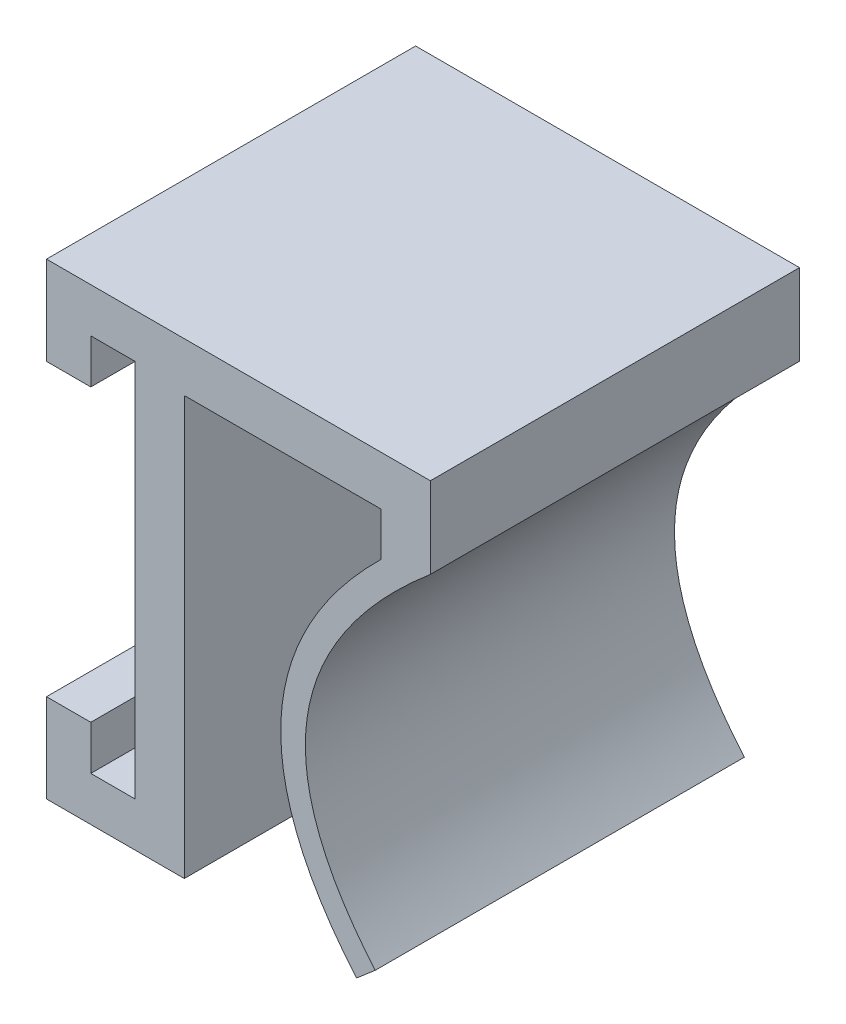
ISO-10303-21;
HEADER;
FILE_DESCRIPTION(('STEP AP214'),'2;1');
FILE_NAME('part.step','',(''),(''),'','','');
FILE_SCHEMA(('AUTOMOTIVE_DESIGN { 1 0 10303 214 1 1 1 1 }'));
ENDSEC;
DATA;
#1=APPLICATION_CONTEXT('core data for automotive mechanical design processes');
#2=APPLICATION_PROTOCOL_DEFINITION('international standard','automotive_design',2000,#1);
#3=PRODUCT_CONTEXT('',#1,'mechanical');
#4=PRODUCT('Part','Part','',(#3));
#5=PRODUCT_RELATED_PRODUCT_CATEGORY('part','',(#4));
#6=PRODUCT_DEFINITION_FORMATION('','',#4);
#7=PRODUCT_DEFINITION_CONTEXT('part definition',#1,'design');
#8=PRODUCT_DEFINITION('design','',#6,#7);
#9=PRODUCT_DEFINITION_SHAPE('','',#8);
#10=(LENGTH_UNIT() NAMED_UNIT(*) SI_UNIT(.MILLI.,.METRE.));
#11=(NAMED_UNIT(*) PLANE_ANGLE_UNIT() SI_UNIT($,.RADIAN.));
#12=(NAMED_UNIT(*) SI_UNIT($,.STERADIAN.) SOLID_ANGLE_UNIT());
#13=UNCERTAINTY_MEASURE_WITH_UNIT(LENGTH_MEASURE(1.E-05),#10,'distance_accuracy_value','');
#14=(GEOMETRIC_REPRESENTATION_CONTEXT(3) GLOBAL_UNCERTAINTY_ASSIGNED_CONTEXT((#13)) GLOBAL_UNIT_ASSIGNED_CONTEXT((#10,
#11,#12)) REPRESENTATION_CONTEXT('',''));
#15=CARTESIAN_POINT('',(0.,0.,0.));
#16=DIRECTION('',(0.,0.,1.));
#17=DIRECTION('',(1.,0.,0.));
#18=AXIS2_PLACEMENT_3D('',#15,#16,#17);
#19=CARTESIAN_POINT('',(-4.6,7.7,0.));
#20=DIRECTION('',(0.,1.,0.));
#21=DIRECTION('',(0.,0.,1.));
#22=AXIS2_PLACEMENT_3D('',#19,#20,#21);
#23=PLANE('',#22);
#24=DIRECTION('',(0.,0.,1.));
#25=VECTOR('',#24,1.);
#26=CARTESIAN_POINT('',(-2.8,7.7,0.));
#27=LINE('',#26,#25);
#28=CARTESIAN_POINT('',(-2.8,7.7,0.));
#29=VERTEX_POINT('',#28);
#30=CARTESIAN_POINT('',(-2.8,7.7,15.));
#31=VERTEX_POINT('',#30);
#32=EDGE_CURVE('E191',#29,#31,#27,.T.);
#33=ORIENTED_EDGE('',*,*,#32,.F.);
#34=DIRECTION('',(1.,0.,0.));
#35=VECTOR('',#34,1.);
#36=CARTESIAN_POINT('',(-4.6,7.7,0.));
#37=LINE('',#36,#35);
#38=CARTESIAN_POINT('',(-1.,7.7,0.));
#39=VERTEX_POINT('',#38);
#40=EDGE_CURVE('E39',#29,#39,#37,.T.);
#41=ORIENTED_EDGE('',*,*,#40,.T.);
#42=DIRECTION('',(0.,0.,1.));
#43=VECTOR('',#42,1.);
#44=CARTESIAN_POINT('',(-1.,7.7,0.));
#45=LINE('',#44,#43);
#46=CARTESIAN_POINT('',(-1.,7.7,15.));
#47=VERTEX_POINT('',#46);
#48=EDGE_CURVE('E176',#39,#47,#45,.T.);
#49=ORIENTED_EDGE('',*,*,#48,.T.);
#50=DIRECTION('',(1.,0.,0.));
#51=VECTOR('',#50,1.);
#52=CARTESIAN_POINT('',(-4.6,7.7,15.));
#53=LINE('',#52,#51);
#54=EDGE_CURVE('E232',#31,#47,#53,.T.);
#55=ORIENTED_EDGE('',*,*,#54,.F.);
#56=EDGE_LOOP('',(#33,#41,#49,#55));
#57=FACE_BOUND('',#56,.T.);
#58=ADVANCED_FACE('F35',(#57),#23,.F.);
#59=CARTESIAN_POINT('',(-4.6,-7.7,15.));
#60=DIRECTION('',(0.,-1.,0.));
#61=DIRECTION('',(0.,0.,-1.));
#62=AXIS2_PLACEMENT_3D('',#59,#60,#61);
#63=PLANE('',#62);
#64=DIRECTION('',(0.,0.,-1.));
#65=VECTOR('',#64,1.);
#66=CARTESIAN_POINT('',(-2.8,-7.7,15.));
#67=LINE('',#66,#65);
#68=CARTESIAN_POINT('',(-2.8,-7.7,15.));
#69=VERTEX_POINT('',#68);
#70=CARTESIAN_POINT('',(-2.8,-7.7,0.));
#71=VERTEX_POINT('',#70);
#72=EDGE_CURVE('E201',#69,#71,#67,.T.);
#73=ORIENTED_EDGE('',*,*,#72,.F.);
#74=DIRECTION('',(1.,0.,0.));
#75=VECTOR('',#74,1.);
#76=CARTESIAN_POINT('',(-4.6,-7.7,15.));
#77=LINE('',#76,#75);
#78=CARTESIAN_POINT('',(-1.,-7.7,15.));
#79=VERTEX_POINT('',#78);
#80=EDGE_CURVE('E228',#69,#79,#77,.T.);
#81=ORIENTED_EDGE('',*,*,#80,.T.);
#82=DIRECTION('',(0.,0.,-1.));
#83=VECTOR('',#82,1.);
#84=CARTESIAN_POINT('',(-1.,-7.7,15.));
#85=LINE('',#84,#83);
#86=CARTESIAN_POINT('',(-1.,-7.7,0.));
#87=VERTEX_POINT('',#86);
#88=EDGE_CURVE('E217',#79,#87,#85,.T.);
#89=ORIENTED_EDGE('',*,*,#88,.T.);
#90=DIRECTION('',(1.,0.,0.));
#91=VECTOR('',#90,1.);
#92=CARTESIAN_POINT('',(-4.6,-7.7,0.));
#93=LINE('',#92,#91);
#94=EDGE_CURVE('E53',#71,#87,#93,.T.);
#95=ORIENTED_EDGE('',*,*,#94,.F.);
#96=EDGE_LOOP('',(#73,#81,#89,#95));
#97=FACE_BOUND('',#96,.T.);
#98=ADVANCED_FACE('F357',(#97),#63,.F.);
#99=CARTESIAN_POINT('',(-1.,0.,15.));
#100=DIRECTION('',(-1.,0.,0.));
#101=DIRECTION('',(0.,0.,1.));
#102=AXIS2_PLACEMENT_3D('',#99,#100,#101);
#103=PLANE('',#102);
#104=DIRECTION('',(0.,1.,0.));
#105=VECTOR('',#104,1.);
#106=CARTESIAN_POINT('',(-1.,0.,0.));
#107=LINE('',#106,#105);
#108=EDGE_CURVE('E249',#87,#39,#107,.T.);
#109=ORIENTED_EDGE('',*,*,#108,.F.);
#110=ORIENTED_EDGE('',*,*,#88,.F.);
#111=DIRECTION('',(0.,1.,0.));
#112=VECTOR('',#111,1.);
#113=CARTESIAN_POINT('',(-1.,0.,15.));
#114=LINE('',#113,#112);
#115=EDGE_CURVE('E244',#79,#47,#114,.T.);
#116=ORIENTED_EDGE('',*,*,#115,.T.);
#117=ORIENTED_EDGE('',*,*,#48,.F.);
#118=EDGE_LOOP('',(#109,#110,#116,#117));
#119=FACE_BOUND('',#118,.T.);
#120=ADVANCED_FACE('F354',(#119),#103,.T.);
#121=CARTESIAN_POINT('',(9.00000000000001,0.,15.));
#122=DIRECTION('',(1.,0.,0.));
#123=DIRECTION('',(0.,1.,0.));
#124=AXIS2_PLACEMENT_3D('',#121,#122,#123);
#125=PLANE('',#124);
#126=DIRECTION('',(0.,-1.,0.));
#127=VECTOR('',#126,1.);
#128=CARTESIAN_POINT('',(9.00000000000001,0.,0.));
#129=LINE('',#128,#127);
#130=CARTESIAN_POINT('',(9.,7.5,0.));
#131=VERTEX_POINT('',#130);
#132=CARTESIAN_POINT('',(9.00000000000039,5.73432637373186,0.));
#133=VERTEX_POINT('',#132);
#134=EDGE_CURVE('E261',#131,#133,#129,.T.);
#135=ORIENTED_EDGE('',*,*,#134,.T.);
#136=DIRECTION('',(0.,0.,-1.));
#137=VECTOR('',#136,1.);
#138=CARTESIAN_POINT('',(9.00000000000039,5.73432637373186,15.));
#139=LINE('',#138,#137);
#140=CARTESIAN_POINT('',(9.00000000000039,5.73432637373186,15.));
#141=VERTEX_POINT('',#140);
#142=EDGE_CURVE('E11',#141,#133,#139,.T.);
#143=ORIENTED_EDGE('',*,*,#142,.F.);
#144=DIRECTION('',(0.,-1.,0.));
#145=VECTOR('',#144,1.);
#146=CARTESIAN_POINT('',(9.00000000000001,0.,15.));
#147=LINE('',#146,#145);
#148=CARTESIAN_POINT('',(9.,7.5,15.));
#149=VERTEX_POINT('',#148);
#150=EDGE_CURVE('E235',#149,#141,#147,.T.);
#151=ORIENTED_EDGE('',*,*,#150,.F.);
#152=DIRECTION('',(0.,0.,-1.));
#153=VECTOR('',#152,1.);
#154=CARTESIAN_POINT('',(9.,7.5,15.));
#155=LINE('',#154,#153);
#156=EDGE_CURVE('E260',#149,#131,#155,.T.);
#157=ORIENTED_EDGE('',*,*,#156,.T.);
#158=EDGE_LOOP('',(#135,#143,#151,#157));
#159=FACE_BOUND('',#158,.T.);
#160=ADVANCED_FACE('F37',(#159),#125,.F.);
#161=CARTESIAN_POINT('',(11.,7.5,15.));
#162=CARTESIAN_POINT('',(0.592095981717063,-0.840980976825272,15.));
#163=CARTESIAN_POINT('',(8.,-9.5,15.));
#164=B_SPLINE_CURVE_WITH_KNOTS('',2,(#161,#162,#163),.UNSPECIFIED.,.F.,.F.,(3,3),(0.,1.),.UNSPECIFIED.);
#165=DIRECTION('',(0.,0.,-1.));
#166=VECTOR('',#165,1.);
#167=SURFACE_OF_LINEAR_EXTRUSION('',#164,#166);
#168=CARTESIAN_POINT('',(11.,7.5,0.));
#169=CARTESIAN_POINT('',(0.592095981717063,-0.840980976825272,0.));
#170=CARTESIAN_POINT('',(8.,-9.5,0.));
#171=B_SPLINE_CURVE_WITH_KNOTS('',2,(#168,#169,#170),.UNSPECIFIED.,.F.,.F.,(3,3),(0.,1.),.UNSPECIFIED.);
#172=CARTESIAN_POINT('',(8.,-9.5,0.));
#173=VERTEX_POINT('',#172);
#174=EDGE_CURVE('E264',#133,#173,#171,.T.);
#175=ORIENTED_EDGE('',*,*,#174,.T.);
#176=DIRECTION('',(0.,0.,-1.));
#177=VECTOR('',#176,1.);
#178=CARTESIAN_POINT('',(8.,-9.5,15.));
#179=LINE('',#178,#177);
#180=CARTESIAN_POINT('',(8.,-9.5,15.));
#181=VERTEX_POINT('',#180);
#182=EDGE_CURVE('E45',#181,#173,#179,.T.);
#183=ORIENTED_EDGE('',*,*,#182,.F.);
#184=EDGE_CURVE('E330',#141,#181,#164,.T.);
#185=ORIENTED_EDGE('',*,*,#184,.F.);
#186=ORIENTED_EDGE('',*,*,#142,.T.);
#187=EDGE_LOOP('',(#175,#183,#185,#186));
#188=FACE_BOUND('',#187,.T.);
#189=ADVANCED_FACE('F316',(#188),#167,.F.);
#190=CARTESIAN_POINT('',(8.07354584516219,-9.43708056762009,15.));
#191=DIRECTION('',(0.650077174667521,-0.759868190527998,0.));
#192=DIRECTION('',(0.759868190527998,0.650077174667521,0.));
#193=AXIS2_PLACEMENT_3D('',#190,#191,#192);
#194=PLANE('',#193);
#195=DIRECTION('',(-0.759868190527998,-0.650077174667521,0.));
#196=VECTOR('',#195,1.);
#197=CARTESIAN_POINT('',(8.07354584516219,-9.43708056762009,0.));
#198=LINE('',#197,#196);
#199=CARTESIAN_POINT('',(8.759868190528,-8.84992282533248,0.));
#200=VERTEX_POINT('',#199);
#201=EDGE_CURVE('E269',#200,#173,#198,.T.);
#202=ORIENTED_EDGE('',*,*,#201,.F.);
#203=DIRECTION('',(0.,0.,-1.));
#204=VECTOR('',#203,1.);
#205=CARTESIAN_POINT('',(8.759868190528,-8.84992282533248,15.));
#206=LINE('',#205,#204);
#207=CARTESIAN_POINT('',(8.759868190528,-8.84992282533248,15.));
#208=VERTEX_POINT('',#207);
#209=EDGE_CURVE('E307',#208,#200,#206,.T.);
#210=ORIENTED_EDGE('',*,*,#209,.F.);
#211=DIRECTION('',(-0.759868190527998,-0.650077174667521,0.));
#212=VECTOR('',#211,1.);
#213=CARTESIAN_POINT('',(8.07354584516219,-9.43708056762009,15.));
#214=LINE('',#213,#212);
#215=EDGE_CURVE('E314',#208,#181,#214,.T.);
#216=ORIENTED_EDGE('',*,*,#215,.T.);
#217=ORIENTED_EDGE('',*,*,#182,.T.);
#218=EDGE_LOOP('',(#202,#210,#216,#217));
#219=FACE_BOUND('',#218,.T.);
#220=ADVANCED_FACE('F312',(#219),#194,.T.);
#221=CARTESIAN_POINT('',(11.6252023520057,6.71987289932823,15.));
#222=CARTESIAN_POINT('',(11.2201200589902,6.39522829510964,15.));
#223=CARTESIAN_POINT('',(10.4068109883159,5.70660676669036,15.));
#224=CARTESIAN_POINT('',(9.02350357029025,4.3793638637013,15.));
#225=CARTESIAN_POINT('',(7.63170789449937,2.72393121403036,15.));
#226=CARTESIAN_POINT('',(6.52663273633452,0.788286780544515,15.));
#227=CARTESIAN_POINT('',(5.9482411045491,-1.09822776469567,15.));
#228=CARTESIAN_POINT('',(5.8646344959865,-2.96072734929349,15.));
#229=CARTESIAN_POINT('',(6.26749430991719,-4.85251733804873,15.));
#230=CARTESIAN_POINT('',(7.04066869306095,-6.49045684792217,15.));
#231=CARTESIAN_POINT('',(7.92360645115797,-7.82176495390924,15.));
#232=CARTESIAN_POINT('',(8.47789668371057,-8.5203376802509,15.));
#233=CARTESIAN_POINT('',(8.75986819052797,-8.84992282533248,15.));
#234=B_SPLINE_CURVE_WITH_KNOTS('',3,(#221,#222,#223,#224,#225,#226,#227,#228,#229,#230,#231,
#232,#233),.UNSPECIFIED.,.F.,.F.,(4,1,1,1,1,1,1,1,1,1,4),(0.,0.0625,0.125,0.25,0.375,0.5,0.625,
0.75,0.875,0.9375,1.),.UNSPECIFIED.);
#235=DIRECTION('',(0.,0.,-1.));
#236=VECTOR('',#235,1.);
#237=SURFACE_OF_LINEAR_EXTRUSION('',#234,#236);
#238=CARTESIAN_POINT('',(11.6252023520057,6.71987289932823,0.));
#239=CARTESIAN_POINT('',(11.2201200589902,6.39522829510964,0.));
#240=CARTESIAN_POINT('',(10.4068109883159,5.70660676669036,0.));
#241=CARTESIAN_POINT('',(9.02350357029025,4.3793638637013,0.));
#242=CARTESIAN_POINT('',(7.63170789449937,2.72393121403036,0.));
#243=CARTESIAN_POINT('',(6.52663273633452,0.788286780544515,0.));
#244=CARTESIAN_POINT('',(5.9482411045491,-1.09822776469567,0.));
#245=CARTESIAN_POINT('',(5.8646344959865,-2.96072734929349,0.));
#246=CARTESIAN_POINT('',(6.26749430991719,-4.85251733804873,0.));
#247=CARTESIAN_POINT('',(7.04066869306095,-6.49045684792217,0.));
#248=CARTESIAN_POINT('',(7.92360645115797,-7.82176495390924,0.));
#249=CARTESIAN_POINT('',(8.47789668371057,-8.5203376802509,0.));
#250=CARTESIAN_POINT('',(8.75986819052797,-8.84992282533248,0.));
#251=B_SPLINE_CURVE_WITH_KNOTS('',3,(#238,#239,#240,#241,#242,#243,#244,#245,#246,#247,#248,
#249,#250),.UNSPECIFIED.,.F.,.F.,(4,1,1,1,1,1,1,1,1,1,4),(0.,0.0625,0.125,0.25,0.375,0.5,0.625,
0.75,0.875,0.9375,1.),.UNSPECIFIED.);
#252=CARTESIAN_POINT('',(11.,6.20409363639073,0.));
#253=VERTEX_POINT('',#252);
#254=EDGE_CURVE('E275',#253,#200,#251,.T.);
#255=ORIENTED_EDGE('',*,*,#254,.F.);
#256=DIRECTION('',(0.,0.,-1.));
#257=VECTOR('',#256,1.);
#258=CARTESIAN_POINT('',(11.,6.20409363639073,15.));
#259=LINE('',#258,#257);
#260=CARTESIAN_POINT('',(11.,6.20409363639073,15.));
#261=VERTEX_POINT('',#260);
#262=EDGE_CURVE('E305',#261,#253,#259,.T.);
#263=ORIENTED_EDGE('',*,*,#262,.F.);
#264=EDGE_CURVE('E324',#261,#208,#234,.T.);
#265=ORIENTED_EDGE('',*,*,#264,.T.);
#266=ORIENTED_EDGE('',*,*,#209,.T.);
#267=EDGE_LOOP('',(#255,#263,#265,#266));
#268=FACE_BOUND('',#267,.T.);
#269=ADVANCED_FACE('F321',(#268),#237,.T.);
#270=CARTESIAN_POINT('',(11.,0.,15.));
#271=DIRECTION('',(1.,0.,0.));
#272=DIRECTION('',(0.,1.,0.));
#273=AXIS2_PLACEMENT_3D('',#270,#271,#272);
#274=PLANE('',#273);
#275=DIRECTION('',(0.,-1.,0.));
#276=VECTOR('',#275,1.);
#277=CARTESIAN_POINT('',(11.,0.,0.));
#278=LINE('',#277,#276);
#279=CARTESIAN_POINT('',(11.,9.5,0.));
#280=VERTEX_POINT('',#279);
#281=EDGE_CURVE('E280',#280,#253,#278,.T.);
#282=ORIENTED_EDGE('',*,*,#281,.F.);
#283=DIRECTION('',(0.,0.,-1.));
#284=VECTOR('',#283,1.);
#285=CARTESIAN_POINT('',(11.,9.5,15.));
#286=LINE('',#285,#284);
#287=CARTESIAN_POINT('',(11.,9.5,15.));
#288=VERTEX_POINT('',#287);
#289=EDGE_CURVE('E303',#288,#280,#286,.T.);
#290=ORIENTED_EDGE('',*,*,#289,.F.);
#291=DIRECTION('',(0.,-1.,0.));
#292=VECTOR('',#291,1.);
#293=CARTESIAN_POINT('',(11.,0.,15.));
#294=LINE('',#293,#292);
#295=EDGE_CURVE('E332',#288,#261,#294,.T.);
#296=ORIENTED_EDGE('',*,*,#295,.T.);
#297=ORIENTED_EDGE('',*,*,#262,.T.);
#298=EDGE_LOOP('',(#282,#290,#296,#297));
#299=FACE_BOUND('',#298,.T.);
#300=ADVANCED_FACE('F347',(#299),#274,.T.);
#301=CARTESIAN_POINT('',(0.,9.5,15.));
#302=DIRECTION('',(0.,1.,0.));
#303=DIRECTION('',(0.,0.,1.));
#304=AXIS2_PLACEMENT_3D('',#301,#302,#303);
#305=PLANE('',#304);
#306=DIRECTION('',(1.,0.,0.));
#307=VECTOR('',#306,1.);
#308=CARTESIAN_POINT('',(0.,9.5,0.));
#309=LINE('',#308,#307);
#310=CARTESIAN_POINT('',(-4.6,9.5,0.));
#311=VERTEX_POINT('',#310);
#312=EDGE_CURVE('E286',#311,#280,#309,.T.);
#313=ORIENTED_EDGE('',*,*,#312,.F.);
#314=DIRECTION('',(0.,0.,-1.));
#315=VECTOR('',#314,1.);
#316=CARTESIAN_POINT('',(-4.6,9.5,0.));
#317=LINE('',#316,#315);
#318=CARTESIAN_POINT('',(-4.6,9.5,15.));
#319=VERTEX_POINT('',#318);
#320=EDGE_CURVE('E173',#319,#311,#317,.T.);
#321=ORIENTED_EDGE('',*,*,#320,.F.);
#322=DIRECTION('',(1.,0.,0.));
#323=VECTOR('',#322,1.);
#324=CARTESIAN_POINT('',(0.,9.5,15.));
#325=LINE('',#324,#323);
#326=EDGE_CURVE('E248',#319,#288,#325,.T.);
#327=ORIENTED_EDGE('',*,*,#326,.T.);
#328=ORIENTED_EDGE('',*,*,#289,.T.);
#329=EDGE_LOOP('',(#313,#321,#327,#328));
#330=FACE_BOUND('',#329,.T.);
#331=ADVANCED_FACE('F381',(#330),#305,.T.);
#332=CARTESIAN_POINT('',(0.,-9.5,15.));
#333=DIRECTION('',(0.,1.,0.));
#334=DIRECTION('',(0.,0.,1.));
#335=AXIS2_PLACEMENT_3D('',#332,#333,#334);
#336=PLANE('',#335);
#337=DIRECTION('',(1.,0.,0.));
#338=VECTOR('',#337,1.);
#339=CARTESIAN_POINT('',(0.,-9.5,0.));
#340=LINE('',#339,#338);
#341=CARTESIAN_POINT('',(-4.6,-9.5,0.));
#342=VERTEX_POINT('',#341);
#343=CARTESIAN_POINT('',(1.,-9.5,0.));
#344=VERTEX_POINT('',#343);
#345=EDGE_CURVE('E289',#342,#344,#340,.T.);
#346=ORIENTED_EDGE('',*,*,#345,.T.);
#347=DIRECTION('',(0.,0.,-1.));
#348=VECTOR('',#347,1.);
#349=CARTESIAN_POINT('',(1.,-9.5,15.));
#350=LINE('',#349,#348);
#351=CARTESIAN_POINT('',(1.,-9.5,15.));
#352=VERTEX_POINT('',#351);
#353=EDGE_CURVE('E300',#352,#344,#350,.T.);
#354=ORIENTED_EDGE('',*,*,#353,.F.);
#355=DIRECTION('',(1.,0.,0.));
#356=VECTOR('',#355,1.);
#357=CARTESIAN_POINT('',(0.,-9.5,15.));
#358=LINE('',#357,#356);
#359=CARTESIAN_POINT('',(-4.6,-9.5,15.));
#360=VERTEX_POINT('',#359);
#361=EDGE_CURVE('E247',#360,#352,#358,.T.);
#362=ORIENTED_EDGE('',*,*,#361,.F.);
#363=DIRECTION('',(0.,0.,1.));
#364=VECTOR('',#363,1.);
#365=CARTESIAN_POINT('',(-4.6,-9.5,15.));
#366=LINE('',#365,#364);
#367=EDGE_CURVE('E223',#342,#360,#366,.T.);
#368=ORIENTED_EDGE('',*,*,#367,.F.);
#369=EDGE_LOOP('',(#346,#354,#362,#368));
#370=FACE_BOUND('',#369,.T.);
#371=ADVANCED_FACE('F377',(#370),#336,.F.);
#372=CARTESIAN_POINT('',(1.,0.,15.));
#373=DIRECTION('',(-1.,0.,0.));
#374=DIRECTION('',(0.,-1.,0.));
#375=AXIS2_PLACEMENT_3D('',#372,#373,#374);
#376=PLANE('',#375);
#377=DIRECTION('',(0.,1.,0.));
#378=VECTOR('',#377,1.);
#379=CARTESIAN_POINT('',(1.,0.,0.));
#380=LINE('',#379,#378);
#381=CARTESIAN_POINT('',(1.,7.5,0.));
#382=VERTEX_POINT('',#381);
#383=EDGE_CURVE('E291',#344,#382,#380,.T.);
#384=ORIENTED_EDGE('',*,*,#383,.T.);
#385=DIRECTION('',(0.,0.,-1.));
#386=VECTOR('',#385,1.);
#387=CARTESIAN_POINT('',(1.,7.5,15.));
#388=LINE('',#387,#386);
#389=CARTESIAN_POINT('',(1.,7.5,15.));
#390=VERTEX_POINT('',#389);
#391=EDGE_CURVE('E297',#390,#382,#388,.T.);
#392=ORIENTED_EDGE('',*,*,#391,.F.);
#393=DIRECTION('',(0.,1.,0.));
#394=VECTOR('',#393,1.);
#395=CARTESIAN_POINT('',(1.,0.,15.));
#396=LINE('',#395,#394);
#397=EDGE_CURVE('E256',#352,#390,#396,.T.);
#398=ORIENTED_EDGE('',*,*,#397,.F.);
#399=ORIENTED_EDGE('',*,*,#353,.T.);
#400=EDGE_LOOP('',(#384,#392,#398,#399));
#401=FACE_BOUND('',#400,.T.);
#402=ADVANCED_FACE('F373',(#401),#376,.F.);
#403=CARTESIAN_POINT('',(0.,7.5,15.));
#404=DIRECTION('',(0.,1.,0.));
#405=DIRECTION('',(0.,0.,1.));
#406=AXIS2_PLACEMENT_3D('',#403,#404,#405);
#407=PLANE('',#406);
#408=DIRECTION('',(1.,0.,0.));
#409=VECTOR('',#408,1.);
#410=CARTESIAN_POINT('',(0.,7.5,0.));
#411=LINE('',#410,#409);
#412=EDGE_CURVE('E293',#382,#131,#411,.T.);
#413=ORIENTED_EDGE('',*,*,#412,.T.);
#414=ORIENTED_EDGE('',*,*,#156,.F.);
#415=DIRECTION('',(1.,0.,0.));
#416=VECTOR('',#415,1.);
#417=CARTESIAN_POINT('',(0.,7.5,15.));
#418=LINE('',#417,#416);
#419=EDGE_CURVE('E258',#390,#149,#418,.T.);
#420=ORIENTED_EDGE('',*,*,#419,.F.);
#421=ORIENTED_EDGE('',*,*,#391,.T.);
#422=EDGE_LOOP('',(#413,#414,#420,#421));
#423=FACE_BOUND('',#422,.T.);
#424=ADVANCED_FACE('F368',(#423),#407,.F.);
#425=CARTESIAN_POINT('',(0.,0.,15.));
#426=DIRECTION('',(0.,0.,1.));
#427=DIRECTION('',(1.,0.,0.));
#428=AXIS2_PLACEMENT_3D('',#425,#426,#427);
#429=PLANE('',#428);
#430=ORIENTED_EDGE('',*,*,#150,.T.);
#431=ORIENTED_EDGE('',*,*,#184,.T.);
#432=ORIENTED_EDGE('',*,*,#215,.F.);
#433=ORIENTED_EDGE('',*,*,#264,.F.);
#434=ORIENTED_EDGE('',*,*,#295,.F.);
#435=ORIENTED_EDGE('',*,*,#326,.F.);
#436=DIRECTION('',(0.,1.,0.));
#437=VECTOR('',#436,1.);
#438=CARTESIAN_POINT('',(-4.6,9.5,15.));
#439=LINE('',#438,#437);
#440=CARTESIAN_POINT('',(-4.6,5.9,15.));
#441=VERTEX_POINT('',#440);
#442=EDGE_CURVE('E175',#441,#319,#439,.T.);
#443=ORIENTED_EDGE('',*,*,#442,.F.);
#444=DIRECTION('',(-1.,0.,0.));
#445=VECTOR('',#444,1.);
#446=CARTESIAN_POINT('',(-4.6,5.9,15.));
#447=LINE('',#446,#445);
#448=CARTESIAN_POINT('',(-2.8,5.9,15.));
#449=VERTEX_POINT('',#448);
#450=EDGE_CURVE('E190',#449,#441,#447,.T.);
#451=ORIENTED_EDGE('',*,*,#450,.F.);
#452=DIRECTION('',(0.,1.,0.));
#453=VECTOR('',#452,1.);
#454=CARTESIAN_POINT('',(-2.8,5.9,15.));
#455=LINE('',#454,#453);
#456=EDGE_CURVE('E196',#449,#31,#455,.T.);
#457=ORIENTED_EDGE('',*,*,#456,.T.);
#458=ORIENTED_EDGE('',*,*,#54,.T.);
#459=ORIENTED_EDGE('',*,*,#115,.F.);
#460=ORIENTED_EDGE('',*,*,#80,.F.);
#461=DIRECTION('',(0.,-1.,0.));
#462=VECTOR('',#461,1.);
#463=CARTESIAN_POINT('',(-2.8,-5.9,15.));
#464=LINE('',#463,#462);
#465=CARTESIAN_POINT('',(-2.8,-5.9,15.));
#466=VERTEX_POINT('',#465);
#467=EDGE_CURVE('E215',#466,#69,#464,.T.);
#468=ORIENTED_EDGE('',*,*,#467,.F.);
#469=DIRECTION('',(1.,0.,0.));
#470=VECTOR('',#469,1.);
#471=CARTESIAN_POINT('',(-4.6,-5.9,15.));
#472=LINE('',#471,#470);
#473=CARTESIAN_POINT('',(-4.6,-5.9,15.));
#474=VERTEX_POINT('',#473);
#475=EDGE_CURVE('E205',#474,#466,#472,.T.);
#476=ORIENTED_EDGE('',*,*,#475,.F.);
#477=DIRECTION('',(0.,1.,0.));
#478=VECTOR('',#477,1.);
#479=CARTESIAN_POINT('',(-4.6,-9.5,15.));
#480=LINE('',#479,#478);
#481=EDGE_CURVE('E218',#360,#474,#480,.T.);
#482=ORIENTED_EDGE('',*,*,#481,.F.);
#483=ORIENTED_EDGE('',*,*,#361,.T.);
#484=ORIENTED_EDGE('',*,*,#397,.T.);
#485=ORIENTED_EDGE('',*,*,#419,.T.);
#486=EDGE_LOOP('',(#430,#431,#432,#433,#434,#435,#443,#451,#457,#458,#459,#460,#468,#476,#482,
#483,#484,#485));
#487=FACE_BOUND('',#486,.T.);
#488=ADVANCED_FACE('F327',(#487),#429,.T.);
#489=CARTESIAN_POINT('',(0.,0.,0.));
#490=DIRECTION('',(0.,0.,1.));
#491=DIRECTION('',(1.,0.,0.));
#492=AXIS2_PLACEMENT_3D('',#489,#490,#491);
#493=PLANE('',#492);
#494=ORIENTED_EDGE('',*,*,#134,.F.);
#495=ORIENTED_EDGE('',*,*,#412,.F.);
#496=ORIENTED_EDGE('',*,*,#383,.F.);
#497=ORIENTED_EDGE('',*,*,#345,.F.);
#498=DIRECTION('',(0.,-1.,0.));
#499=VECTOR('',#498,1.);
#500=CARTESIAN_POINT('',(-4.6,-9.5,0.));
#501=LINE('',#500,#499);
#502=CARTESIAN_POINT('',(-4.6,-5.9,0.));
#503=VERTEX_POINT('',#502);
#504=EDGE_CURVE('E220',#503,#342,#501,.T.);
#505=ORIENTED_EDGE('',*,*,#504,.F.);
#506=DIRECTION('',(-1.,0.,0.));
#507=VECTOR('',#506,1.);
#508=CARTESIAN_POINT('',(-4.6,-5.9,0.));
#509=LINE('',#508,#507);
#510=CARTESIAN_POINT('',(-2.8,-5.9,0.));
#511=VERTEX_POINT('',#510);
#512=EDGE_CURVE('E209',#511,#503,#509,.T.);
#513=ORIENTED_EDGE('',*,*,#512,.F.);
#514=DIRECTION('',(0.,-1.,0.));
#515=VECTOR('',#514,1.);
#516=CARTESIAN_POINT('',(-2.8,-5.9,0.));
#517=LINE('',#516,#515);
#518=EDGE_CURVE('E212',#511,#71,#517,.T.);
#519=ORIENTED_EDGE('',*,*,#518,.T.);
#520=ORIENTED_EDGE('',*,*,#94,.T.);
#521=ORIENTED_EDGE('',*,*,#108,.T.);
#522=ORIENTED_EDGE('',*,*,#40,.F.);
#523=DIRECTION('',(0.,1.,0.));
#524=VECTOR('',#523,1.);
#525=CARTESIAN_POINT('',(-2.8,5.9,0.));
#526=LINE('',#525,#524);
#527=CARTESIAN_POINT('',(-2.8,5.9,0.));
#528=VERTEX_POINT('',#527);
#529=EDGE_CURVE('E182',#528,#29,#526,.T.);
#530=ORIENTED_EDGE('',*,*,#529,.F.);
#531=DIRECTION('',(1.,0.,0.));
#532=VECTOR('',#531,1.);
#533=CARTESIAN_POINT('',(-4.6,5.9,0.));
#534=LINE('',#533,#532);
#535=CARTESIAN_POINT('',(-4.6,5.9,0.));
#536=VERTEX_POINT('',#535);
#537=EDGE_CURVE('E179',#536,#528,#534,.T.);
#538=ORIENTED_EDGE('',*,*,#537,.F.);
#539=DIRECTION('',(0.,-1.,0.));
#540=VECTOR('',#539,1.);
#541=CARTESIAN_POINT('',(-4.6,9.5,0.));
#542=LINE('',#541,#540);
#543=EDGE_CURVE('E166',#311,#536,#542,.T.);
#544=ORIENTED_EDGE('',*,*,#543,.F.);
#545=ORIENTED_EDGE('',*,*,#312,.T.);
#546=ORIENTED_EDGE('',*,*,#281,.T.);
#547=ORIENTED_EDGE('',*,*,#254,.T.);
#548=ORIENTED_EDGE('',*,*,#201,.T.);
#549=ORIENTED_EDGE('',*,*,#174,.F.);
#550=EDGE_LOOP('',(#494,#495,#496,#497,#505,#513,#519,#520,#521,#522,#530,#538,#544,#545,#546,
#547,#548,#549));
#551=FACE_BOUND('',#550,.T.);
#552=ADVANCED_FACE('F181',(#551),#493,.F.);
#553=CARTESIAN_POINT('',(-4.6,0.,0.));
#554=DIRECTION('',(-1.,0.,0.));
#555=DIRECTION('',(0.,0.,1.));
#556=AXIS2_PLACEMENT_3D('',#553,#554,#555);
#557=PLANE('',#556);
#558=ORIENTED_EDGE('',*,*,#543,.T.);
#559=DIRECTION('',(0.,0.,-1.));
#560=VECTOR('',#559,1.);
#561=CARTESIAN_POINT('',(-4.6,5.9,0.));
#562=LINE('',#561,#560);
#563=EDGE_CURVE('E171',#441,#536,#562,.T.);
#564=ORIENTED_EDGE('',*,*,#563,.F.);
#565=ORIENTED_EDGE('',*,*,#442,.T.);
#566=ORIENTED_EDGE('',*,*,#320,.T.);
#567=EDGE_LOOP('',(#558,#564,#565,#566));
#568=FACE_BOUND('',#567,.T.);
#569=ADVANCED_FACE('F168',(#568),#557,.T.);
#570=CARTESIAN_POINT('',(-4.6,0.,0.));
#571=DIRECTION('',(-1.,0.,0.));
#572=DIRECTION('',(0.,0.,1.));
#573=AXIS2_PLACEMENT_3D('',#570,#571,#572);
#574=PLANE('',#573);
#575=ORIENTED_EDGE('',*,*,#481,.T.);
#576=DIRECTION('',(0.,0.,1.));
#577=VECTOR('',#576,1.);
#578=CARTESIAN_POINT('',(-4.6,-5.9,15.));
#579=LINE('',#578,#577);
#580=EDGE_CURVE('E202',#503,#474,#579,.T.);
#581=ORIENTED_EDGE('',*,*,#580,.F.);
#582=ORIENTED_EDGE('',*,*,#504,.T.);
#583=ORIENTED_EDGE('',*,*,#367,.T.);
#584=EDGE_LOOP('',(#575,#581,#582,#583));
#585=FACE_BOUND('',#584,.T.);
#586=ADVANCED_FACE('F412',(#585),#574,.T.);
#587=CARTESIAN_POINT('',(-2.8,-5.9,15.));
#588=DIRECTION('',(-1.,0.,0.));
#589=DIRECTION('',(0.,0.,1.));
#590=AXIS2_PLACEMENT_3D('',#587,#588,#589);
#591=PLANE('',#590);
#592=ORIENTED_EDGE('',*,*,#72,.T.);
#593=ORIENTED_EDGE('',*,*,#518,.F.);
#594=DIRECTION('',(0.,0.,-1.));
#595=VECTOR('',#594,1.);
#596=CARTESIAN_POINT('',(-2.8,-5.9,15.));
#597=LINE('',#596,#595);
#598=EDGE_CURVE('E207',#466,#511,#597,.T.);
#599=ORIENTED_EDGE('',*,*,#598,.F.);
#600=ORIENTED_EDGE('',*,*,#467,.T.);
#601=EDGE_LOOP('',(#592,#593,#599,#600));
#602=FACE_BOUND('',#601,.T.);
#603=ADVANCED_FACE('F406',(#602),#591,.F.);
#604=CARTESIAN_POINT('',(0.,-5.9,0.));
#605=DIRECTION('',(0.,-1.,0.));
#606=DIRECTION('',(0.,0.,-1.));
#607=AXIS2_PLACEMENT_3D('',#604,#605,#606);
#608=PLANE('',#607);
#609=ORIENTED_EDGE('',*,*,#580,.T.);
#610=ORIENTED_EDGE('',*,*,#475,.T.);
#611=ORIENTED_EDGE('',*,*,#598,.T.);
#612=ORIENTED_EDGE('',*,*,#512,.T.);
#613=EDGE_LOOP('',(#609,#610,#611,#612));
#614=FACE_BOUND('',#613,.T.);
#615=ADVANCED_FACE('F410',(#614),#608,.F.);
#616=CARTESIAN_POINT('',(-2.8,5.9,0.));
#617=DIRECTION('',(-1.,0.,0.));
#618=DIRECTION('',(0.,0.,1.));
#619=AXIS2_PLACEMENT_3D('',#616,#617,#618);
#620=PLANE('',#619);
#621=ORIENTED_EDGE('',*,*,#32,.T.);
#622=ORIENTED_EDGE('',*,*,#456,.F.);
#623=DIRECTION('',(0.,0.,1.));
#624=VECTOR('',#623,1.);
#625=CARTESIAN_POINT('',(-2.8,5.9,0.));
#626=LINE('',#625,#624);
#627=EDGE_CURVE('E185',#528,#449,#626,.T.);
#628=ORIENTED_EDGE('',*,*,#627,.F.);
#629=ORIENTED_EDGE('',*,*,#529,.T.);
#630=EDGE_LOOP('',(#621,#622,#628,#629));
#631=FACE_BOUND('',#630,.T.);
#632=ADVANCED_FACE('F433',(#631),#620,.F.);
#633=CARTESIAN_POINT('',(0.,5.9,0.));
#634=DIRECTION('',(0.,1.,0.));
#635=DIRECTION('',(0.,0.,1.));
#636=AXIS2_PLACEMENT_3D('',#633,#634,#635);
#637=PLANE('',#636);
#638=ORIENTED_EDGE('',*,*,#563,.T.);
#639=ORIENTED_EDGE('',*,*,#537,.T.);
#640=ORIENTED_EDGE('',*,*,#627,.T.);
#641=ORIENTED_EDGE('',*,*,#450,.T.);
#642=EDGE_LOOP('',(#638,#639,#640,#641));
#643=FACE_BOUND('',#642,.T.);
#644=ADVANCED_FACE('F188',(#643),#637,.F.);
#645=CLOSED_SHELL('',(#58,#98,#120,#160,#189,#220,#269,#300,#331,#371,#402,#424,#488,#552,#569,
#586,#603,#615,#632,#644));
#646=MANIFOLD_SOLID_BREP('B2',#645);
#647=ADVANCED_BREP_SHAPE_REPRESENTATION('',(#18,#646),#14);
#648=SHAPE_DEFINITION_REPRESENTATION(#9,#647);
ENDSEC;
END-ISO-10303-21;
